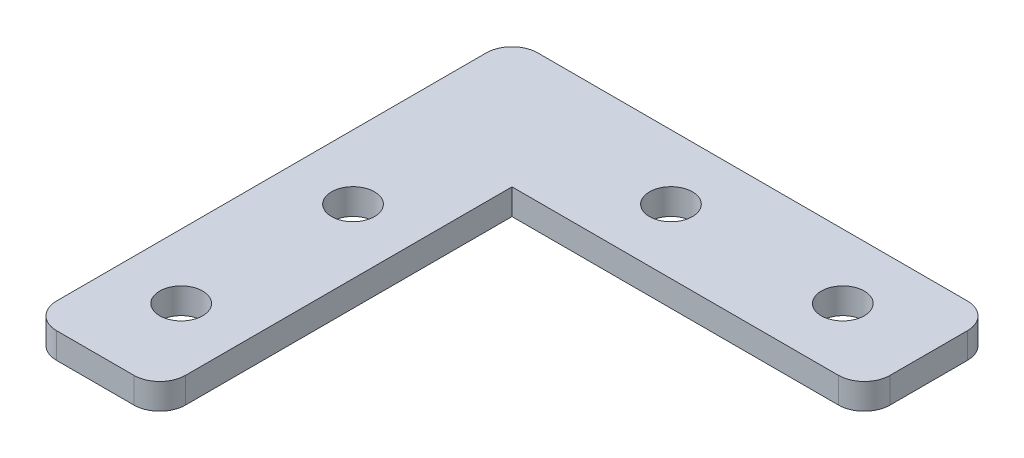
ISO-10303-21;
HEADER;
FILE_DESCRIPTION(('STEP AP214'),'2;1');
FILE_NAME('part.step','',(''),(''),'','','');
FILE_SCHEMA(('AUTOMOTIVE_DESIGN { 1 0 10303 214 1 1 1 1 }'));
ENDSEC;
DATA;
#1=APPLICATION_CONTEXT('core data for automotive mechanical design processes');
#2=APPLICATION_PROTOCOL_DEFINITION('international standard','automotive_design',2000,#1);
#3=PRODUCT_CONTEXT('',#1,'mechanical');
#4=PRODUCT('Part','Part','',(#3));
#5=PRODUCT_RELATED_PRODUCT_CATEGORY('part','',(#4));
#6=PRODUCT_DEFINITION_FORMATION('','',#4);
#7=PRODUCT_DEFINITION_CONTEXT('part definition',#1,'design');
#8=PRODUCT_DEFINITION('design','',#6,#7);
#9=PRODUCT_DEFINITION_SHAPE('','',#8);
#10=(LENGTH_UNIT() NAMED_UNIT(*) SI_UNIT(.MILLI.,.METRE.));
#11=(NAMED_UNIT(*) PLANE_ANGLE_UNIT() SI_UNIT($,.RADIAN.));
#12=(NAMED_UNIT(*) SI_UNIT($,.STERADIAN.) SOLID_ANGLE_UNIT());
#13=UNCERTAINTY_MEASURE_WITH_UNIT(LENGTH_MEASURE(1.E-05),#10,'distance_accuracy_value','');
#14=(GEOMETRIC_REPRESENTATION_CONTEXT(3) GLOBAL_UNCERTAINTY_ASSIGNED_CONTEXT((#13)) GLOBAL_UNIT_ASSIGNED_CONTEXT((#10,
#11,#12)) REPRESENTATION_CONTEXT('',''));
#15=CARTESIAN_POINT('',(0.,0.,0.));
#16=DIRECTION('',(0.,0.,1.));
#17=DIRECTION('',(1.,0.,0.));
#18=AXIS2_PLACEMENT_3D('',#15,#16,#17);
#19=CARTESIAN_POINT('',(0.,3.,0.));
#20=DIRECTION('',(0.,-1.,0.));
#21=DIRECTION('',(0.,0.,-1.));
#22=AXIS2_PLACEMENT_3D('',#19,#20,#21);
#23=PLANE('',#22);
#24=DIRECTION('',(-1.,0.,0.));
#25=VECTOR('',#24,1.);
#26=CARTESIAN_POINT('',(-28.,3.,-28.));
#27=LINE('',#26,#25);
#28=CARTESIAN_POINT('',(25.,3.,-28.));
#29=VERTEX_POINT('',#28);
#30=CARTESIAN_POINT('',(-25.,3.,-28.));
#31=VERTEX_POINT('',#30);
#32=EDGE_CURVE('E128',#29,#31,#27,.T.);
#33=ORIENTED_EDGE('',*,*,#32,.T.);
#34=CARTESIAN_POINT('',(-25.,3.,-25.));
#35=DIRECTION('',(0.,-1.,0.));
#36=DIRECTION('',(0.,0.,-1.));
#37=AXIS2_PLACEMENT_3D('',#34,#35,#36);
#38=CIRCLE('',#37,3.);
#39=CARTESIAN_POINT('',(-28.,3.,-25.));
#40=VERTEX_POINT('',#39);
#41=EDGE_CURVE('E175',#31,#40,#38,.F.);
#42=ORIENTED_EDGE('',*,*,#41,.T.);
#43=DIRECTION('',(0.,0.,1.));
#44=VECTOR('',#43,1.);
#45=CARTESIAN_POINT('',(-28.,3.,28.));
#46=LINE('',#45,#44);
#47=CARTESIAN_POINT('',(-28.,3.,25.));
#48=VERTEX_POINT('',#47);
#49=EDGE_CURVE('E121',#40,#48,#46,.T.);
#50=ORIENTED_EDGE('',*,*,#49,.T.);
#51=CARTESIAN_POINT('',(-25.,3.,25.));
#52=DIRECTION('',(0.,-1.,0.));
#53=DIRECTION('',(0.,0.,-1.));
#54=AXIS2_PLACEMENT_3D('',#51,#52,#53);
#55=CIRCLE('',#54,3.);
#56=CARTESIAN_POINT('',(-25.,3.,28.));
#57=VERTEX_POINT('',#56);
#58=EDGE_CURVE('E169',#48,#57,#55,.F.);
#59=ORIENTED_EDGE('',*,*,#58,.T.);
#60=DIRECTION('',(1.,0.,0.));
#61=VECTOR('',#60,1.);
#62=CARTESIAN_POINT('',(-13.,3.,28.));
#63=LINE('',#62,#61);
#64=CARTESIAN_POINT('',(-16.,3.,28.));
#65=VERTEX_POINT('',#64);
#66=EDGE_CURVE('E110',#57,#65,#63,.T.);
#67=ORIENTED_EDGE('',*,*,#66,.T.);
#68=CARTESIAN_POINT('',(-16.,3.,25.));
#69=DIRECTION('',(0.,-1.,0.));
#70=DIRECTION('',(0.,0.,-1.));
#71=AXIS2_PLACEMENT_3D('',#68,#69,#70);
#72=CIRCLE('',#71,3.);
#73=CARTESIAN_POINT('',(-13.,3.,25.));
#74=VERTEX_POINT('',#73);
#75=EDGE_CURVE('E106',#65,#74,#72,.F.);
#76=ORIENTED_EDGE('',*,*,#75,.T.);
#77=DIRECTION('',(0.,0.,-1.));
#78=VECTOR('',#77,1.);
#79=CARTESIAN_POINT('',(-13.,3.,-13.));
#80=LINE('',#79,#78);
#81=CARTESIAN_POINT('',(-13.,3.,-13.));
#82=VERTEX_POINT('',#81);
#83=EDGE_CURVE('E98',#74,#82,#80,.T.);
#84=ORIENTED_EDGE('',*,*,#83,.T.);
#85=DIRECTION('',(1.,0.,0.));
#86=VECTOR('',#85,1.);
#87=CARTESIAN_POINT('',(28.,3.,-13.));
#88=LINE('',#87,#86);
#89=CARTESIAN_POINT('',(25.,3.,-13.));
#90=VERTEX_POINT('',#89);
#91=EDGE_CURVE('E103',#82,#90,#88,.T.);
#92=ORIENTED_EDGE('',*,*,#91,.T.);
#93=CARTESIAN_POINT('',(25.,3.,-16.));
#94=DIRECTION('',(0.,-1.,0.));
#95=DIRECTION('',(0.,0.,-1.));
#96=AXIS2_PLACEMENT_3D('',#93,#94,#95);
#97=CIRCLE('',#96,3.);
#98=CARTESIAN_POINT('',(28.,3.,-16.));
#99=VERTEX_POINT('',#98);
#100=EDGE_CURVE('E38',#90,#99,#97,.F.);
#101=ORIENTED_EDGE('',*,*,#100,.T.);
#102=DIRECTION('',(0.,0.,-1.));
#103=VECTOR('',#102,1.);
#104=CARTESIAN_POINT('',(28.,3.,-28.));
#105=LINE('',#104,#103);
#106=CARTESIAN_POINT('',(28.,3.,-25.));
#107=VERTEX_POINT('',#106);
#108=EDGE_CURVE('E126',#99,#107,#105,.T.);
#109=ORIENTED_EDGE('',*,*,#108,.T.);
#110=CARTESIAN_POINT('',(25.,3.,-25.));
#111=DIRECTION('',(0.,-1.,0.));
#112=DIRECTION('',(0.,0.,-1.));
#113=AXIS2_PLACEMENT_3D('',#110,#111,#112);
#114=CIRCLE('',#113,3.);
#115=EDGE_CURVE('E173',#107,#29,#114,.F.);
#116=ORIENTED_EDGE('',*,*,#115,.T.);
#117=EDGE_LOOP('',(#33,#42,#50,#59,#67,#76,#84,#92,#101,#109,#116));
#118=FACE_BOUND('',#117,.T.);
#119=CARTESIAN_POINT('',(-20.5,3.,18.));
#120=DIRECTION('',(0.,1.,0.));
#121=DIRECTION('',(0.,0.,1.));
#122=AXIS2_PLACEMENT_3D('',#119,#120,#121);
#123=CIRCLE('',#122,2.5);
#124=CARTESIAN_POINT('',(-20.5,3.,20.5));
#125=VERTEX_POINT('',#124);
#126=EDGE_CURVE('E138',#125,#125,#123,.T.);
#127=ORIENTED_EDGE('',*,*,#126,.F.);
#128=EDGE_LOOP('',(#127));
#129=FACE_BOUND('',#128,.T.);
#130=CARTESIAN_POINT('',(-1.99999999999999,3.,-20.5));
#131=DIRECTION('',(0.,1.,0.));
#132=DIRECTION('',(0.,0.,1.));
#133=AXIS2_PLACEMENT_3D('',#130,#131,#132);
#134=CIRCLE('',#133,2.5);
#135=CARTESIAN_POINT('',(-1.99999999999999,3.,-18.));
#136=VERTEX_POINT('',#135);
#137=EDGE_CURVE('E202',#136,#136,#134,.T.);
#138=ORIENTED_EDGE('',*,*,#137,.F.);
#139=EDGE_LOOP('',(#138));
#140=FACE_BOUND('',#139,.T.);
#141=CARTESIAN_POINT('',(-20.5,3.,-2.));
#142=DIRECTION('',(0.,1.,0.));
#143=DIRECTION('',(0.,0.,1.));
#144=AXIS2_PLACEMENT_3D('',#141,#142,#143);
#145=CIRCLE('',#144,2.5);
#146=CARTESIAN_POINT('',(-20.5,3.,0.5));
#147=VERTEX_POINT('',#146);
#148=EDGE_CURVE('E208',#147,#147,#145,.T.);
#149=ORIENTED_EDGE('',*,*,#148,.F.);
#150=EDGE_LOOP('',(#149));
#151=FACE_BOUND('',#150,.T.);
#152=CARTESIAN_POINT('',(18.,3.,-20.5));
#153=DIRECTION('',(0.,1.,0.));
#154=DIRECTION('',(0.,0.,1.));
#155=AXIS2_PLACEMENT_3D('',#152,#153,#154);
#156=CIRCLE('',#155,2.5);
#157=CARTESIAN_POINT('',(18.,3.,-18.));
#158=VERTEX_POINT('',#157);
#159=EDGE_CURVE('E214',#158,#158,#156,.T.);
#160=ORIENTED_EDGE('',*,*,#159,.F.);
#161=EDGE_LOOP('',(#160));
#162=FACE_BOUND('',#161,.T.);
#163=ADVANCED_FACE('F16',(#118,#129,#140,#151,#162),#23,.F.);
#164=CARTESIAN_POINT('',(0.,0.,0.));
#165=DIRECTION('',(0.,-1.,0.));
#166=DIRECTION('',(0.,0.,-1.));
#167=AXIS2_PLACEMENT_3D('',#164,#165,#166);
#168=PLANE('',#167);
#169=CARTESIAN_POINT('',(-20.5,0.,-2.));
#170=DIRECTION('',(0.,1.,0.));
#171=DIRECTION('',(0.,0.,1.));
#172=AXIS2_PLACEMENT_3D('',#169,#170,#171);
#173=CIRCLE('',#172,2.5);
#174=CARTESIAN_POINT('',(-20.5,0.,0.5));
#175=VERTEX_POINT('',#174);
#176=EDGE_CURVE('E211',#175,#175,#173,.T.);
#177=ORIENTED_EDGE('',*,*,#176,.T.);
#178=EDGE_LOOP('',(#177));
#179=FACE_BOUND('',#178,.T.);
#180=CARTESIAN_POINT('',(-20.5,0.,18.));
#181=DIRECTION('',(0.,1.,0.));
#182=DIRECTION('',(0.,0.,1.));
#183=AXIS2_PLACEMENT_3D('',#180,#181,#182);
#184=CIRCLE('',#183,2.5);
#185=CARTESIAN_POINT('',(-20.5,0.,20.5));
#186=VERTEX_POINT('',#185);
#187=EDGE_CURVE('E199',#186,#186,#184,.T.);
#188=ORIENTED_EDGE('',*,*,#187,.T.);
#189=EDGE_LOOP('',(#188));
#190=FACE_BOUND('',#189,.T.);
#191=DIRECTION('',(0.,0.,1.));
#192=VECTOR('',#191,1.);
#193=CARTESIAN_POINT('',(-28.,0.,28.));
#194=LINE('',#193,#192);
#195=CARTESIAN_POINT('',(-28.,0.,-25.));
#196=VERTEX_POINT('',#195);
#197=CARTESIAN_POINT('',(-28.,0.,25.));
#198=VERTEX_POINT('',#197);
#199=EDGE_CURVE('E147',#196,#198,#194,.T.);
#200=ORIENTED_EDGE('',*,*,#199,.F.);
#201=CARTESIAN_POINT('',(-25.,0.,-25.));
#202=DIRECTION('',(0.,-1.,0.));
#203=DIRECTION('',(0.,0.,-1.));
#204=AXIS2_PLACEMENT_3D('',#201,#202,#203);
#205=CIRCLE('',#204,3.);
#206=CARTESIAN_POINT('',(-25.,0.,-28.));
#207=VERTEX_POINT('',#206);
#208=EDGE_CURVE('E162',#196,#207,#205,.T.);
#209=ORIENTED_EDGE('',*,*,#208,.T.);
#210=DIRECTION('',(-1.,0.,0.));
#211=VECTOR('',#210,1.);
#212=CARTESIAN_POINT('',(-28.,0.,-28.));
#213=LINE('',#212,#211);
#214=CARTESIAN_POINT('',(25.,0.,-28.));
#215=VERTEX_POINT('',#214);
#216=EDGE_CURVE('E144',#215,#207,#213,.T.);
#217=ORIENTED_EDGE('',*,*,#216,.F.);
#218=CARTESIAN_POINT('',(25.,0.,-25.));
#219=DIRECTION('',(0.,-1.,0.));
#220=DIRECTION('',(0.,0.,-1.));
#221=AXIS2_PLACEMENT_3D('',#218,#219,#220);
#222=CIRCLE('',#221,3.);
#223=CARTESIAN_POINT('',(28.,0.,-25.));
#224=VERTEX_POINT('',#223);
#225=EDGE_CURVE('E160',#215,#224,#222,.T.);
#226=ORIENTED_EDGE('',*,*,#225,.T.);
#227=DIRECTION('',(0.,0.,-1.));
#228=VECTOR('',#227,1.);
#229=CARTESIAN_POINT('',(28.,0.,-28.));
#230=LINE('',#229,#228);
#231=CARTESIAN_POINT('',(28.,0.,-16.));
#232=VERTEX_POINT('',#231);
#233=EDGE_CURVE('E142',#232,#224,#230,.T.);
#234=ORIENTED_EDGE('',*,*,#233,.F.);
#235=CARTESIAN_POINT('',(25.,0.,-16.));
#236=DIRECTION('',(0.,-1.,0.));
#237=DIRECTION('',(0.,0.,-1.));
#238=AXIS2_PLACEMENT_3D('',#235,#236,#237);
#239=CIRCLE('',#238,3.);
#240=CARTESIAN_POINT('',(25.,0.,-13.));
#241=VERTEX_POINT('',#240);
#242=EDGE_CURVE('E158',#232,#241,#239,.T.);
#243=ORIENTED_EDGE('',*,*,#242,.T.);
#244=DIRECTION('',(1.,0.,0.));
#245=VECTOR('',#244,1.);
#246=CARTESIAN_POINT('',(28.,0.,-13.));
#247=LINE('',#246,#245);
#248=CARTESIAN_POINT('',(-13.,0.,-13.));
#249=VERTEX_POINT('',#248);
#250=EDGE_CURVE('E140',#249,#241,#247,.T.);
#251=ORIENTED_EDGE('',*,*,#250,.F.);
#252=DIRECTION('',(0.,0.,-1.));
#253=VECTOR('',#252,1.);
#254=CARTESIAN_POINT('',(-13.,0.,-13.));
#255=LINE('',#254,#253);
#256=CARTESIAN_POINT('',(-13.,0.,25.));
#257=VERTEX_POINT('',#256);
#258=EDGE_CURVE('E116',#257,#249,#255,.T.);
#259=ORIENTED_EDGE('',*,*,#258,.F.);
#260=CARTESIAN_POINT('',(-16.,0.,25.));
#261=DIRECTION('',(0.,-1.,0.));
#262=DIRECTION('',(0.,0.,-1.));
#263=AXIS2_PLACEMENT_3D('',#260,#261,#262);
#264=CIRCLE('',#263,3.);
#265=CARTESIAN_POINT('',(-16.,0.,28.));
#266=VERTEX_POINT('',#265);
#267=EDGE_CURVE('E156',#257,#266,#264,.T.);
#268=ORIENTED_EDGE('',*,*,#267,.T.);
#269=DIRECTION('',(1.,0.,0.));
#270=VECTOR('',#269,1.);
#271=CARTESIAN_POINT('',(-13.,0.,28.));
#272=LINE('',#271,#270);
#273=CARTESIAN_POINT('',(-25.,0.,28.));
#274=VERTEX_POINT('',#273);
#275=EDGE_CURVE('E135',#274,#266,#272,.T.);
#276=ORIENTED_EDGE('',*,*,#275,.F.);
#277=CARTESIAN_POINT('',(-25.,0.,25.));
#278=DIRECTION('',(0.,-1.,0.));
#279=DIRECTION('',(0.,0.,-1.));
#280=AXIS2_PLACEMENT_3D('',#277,#278,#279);
#281=CIRCLE('',#280,3.);
#282=EDGE_CURVE('E154',#274,#198,#281,.T.);
#283=ORIENTED_EDGE('',*,*,#282,.T.);
#284=EDGE_LOOP('',(#200,#209,#217,#226,#234,#243,#251,#259,#268,#276,#283));
#285=FACE_BOUND('',#284,.T.);
#286=CARTESIAN_POINT('',(-1.99999999999999,0.,-20.5));
#287=DIRECTION('',(0.,1.,0.));
#288=DIRECTION('',(0.,0.,1.));
#289=AXIS2_PLACEMENT_3D('',#286,#287,#288);
#290=CIRCLE('',#289,2.5);
#291=CARTESIAN_POINT('',(-1.99999999999999,0.,-18.));
#292=VERTEX_POINT('',#291);
#293=EDGE_CURVE('E205',#292,#292,#290,.T.);
#294=ORIENTED_EDGE('',*,*,#293,.T.);
#295=EDGE_LOOP('',(#294));
#296=FACE_BOUND('',#295,.T.);
#297=CARTESIAN_POINT('',(18.,0.,-20.5));
#298=DIRECTION('',(0.,1.,0.));
#299=DIRECTION('',(0.,0.,1.));
#300=AXIS2_PLACEMENT_3D('',#297,#298,#299);
#301=CIRCLE('',#300,2.5);
#302=CARTESIAN_POINT('',(18.,0.,-18.));
#303=VERTEX_POINT('',#302);
#304=EDGE_CURVE('E217',#303,#303,#301,.T.);
#305=ORIENTED_EDGE('',*,*,#304,.T.);
#306=EDGE_LOOP('',(#305));
#307=FACE_BOUND('',#306,.T.);
#308=ADVANCED_FACE('F194',(#179,#190,#285,#296,#307),#168,.T.);
#309=CARTESIAN_POINT('',(-13.,3.,28.));
#310=DIRECTION('',(0.,0.,-1.));
#311=DIRECTION('',(-1.,0.,0.));
#312=AXIS2_PLACEMENT_3D('',#309,#310,#311);
#313=PLANE('',#312);
#314=ORIENTED_EDGE('',*,*,#275,.T.);
#315=DIRECTION('',(0.,-1.,0.));
#316=VECTOR('',#315,1.);
#317=CARTESIAN_POINT('',(-16.,3.,28.));
#318=LINE('',#317,#316);
#319=EDGE_CURVE('E10',#266,#65,#318,.F.);
#320=ORIENTED_EDGE('',*,*,#319,.T.);
#321=ORIENTED_EDGE('',*,*,#66,.F.);
#322=DIRECTION('',(0.,-1.,0.));
#323=VECTOR('',#322,1.);
#324=CARTESIAN_POINT('',(-25.,3.,28.));
#325=LINE('',#324,#323);
#326=EDGE_CURVE('E24',#57,#274,#325,.T.);
#327=ORIENTED_EDGE('',*,*,#326,.T.);
#328=EDGE_LOOP('',(#314,#320,#321,#327));
#329=FACE_BOUND('',#328,.T.);
#330=ADVANCED_FACE('F188',(#329),#313,.F.);
#331=CARTESIAN_POINT('',(-13.,3.,-13.));
#332=DIRECTION('',(-1.,0.,0.));
#333=DIRECTION('',(0.,0.,1.));
#334=AXIS2_PLACEMENT_3D('',#331,#332,#333);
#335=PLANE('',#334);
#336=ORIENTED_EDGE('',*,*,#83,.F.);
#337=DIRECTION('',(0.,-1.,0.));
#338=VECTOR('',#337,1.);
#339=CARTESIAN_POINT('',(-13.,3.,25.));
#340=LINE('',#339,#338);
#341=EDGE_CURVE('E182',#74,#257,#340,.T.);
#342=ORIENTED_EDGE('',*,*,#341,.T.);
#343=ORIENTED_EDGE('',*,*,#258,.T.);
#344=DIRECTION('',(0.,-1.,0.));
#345=VECTOR('',#344,1.);
#346=CARTESIAN_POINT('',(-13.,3.,-13.));
#347=LINE('',#346,#345);
#348=EDGE_CURVE('E113',#82,#249,#347,.T.);
#349=ORIENTED_EDGE('',*,*,#348,.F.);
#350=EDGE_LOOP('',(#336,#342,#343,#349));
#351=FACE_BOUND('',#350,.T.);
#352=ADVANCED_FACE('F114',(#351),#335,.F.);
#353=CARTESIAN_POINT('',(28.,3.,-13.));
#354=DIRECTION('',(0.,0.,-1.));
#355=DIRECTION('',(-1.,0.,0.));
#356=AXIS2_PLACEMENT_3D('',#353,#354,#355);
#357=PLANE('',#356);
#358=ORIENTED_EDGE('',*,*,#250,.T.);
#359=DIRECTION('',(0.,-1.,0.));
#360=VECTOR('',#359,1.);
#361=CARTESIAN_POINT('',(25.,3.,-13.));
#362=LINE('',#361,#360);
#363=EDGE_CURVE('E125',#241,#90,#362,.F.);
#364=ORIENTED_EDGE('',*,*,#363,.T.);
#365=ORIENTED_EDGE('',*,*,#91,.F.);
#366=ORIENTED_EDGE('',*,*,#348,.T.);
#367=EDGE_LOOP('',(#358,#364,#365,#366));
#368=FACE_BOUND('',#367,.T.);
#369=ADVANCED_FACE('F123',(#368),#357,.F.);
#370=CARTESIAN_POINT('',(28.,3.,-28.));
#371=DIRECTION('',(-1.,0.,0.));
#372=DIRECTION('',(0.,0.,1.));
#373=AXIS2_PLACEMENT_3D('',#370,#371,#372);
#374=PLANE('',#373);
#375=ORIENTED_EDGE('',*,*,#233,.T.);
#376=DIRECTION('',(0.,-1.,0.));
#377=VECTOR('',#376,1.);
#378=CARTESIAN_POINT('',(28.,3.,-25.));
#379=LINE('',#378,#377);
#380=EDGE_CURVE('E31',#224,#107,#379,.F.);
#381=ORIENTED_EDGE('',*,*,#380,.T.);
#382=ORIENTED_EDGE('',*,*,#108,.F.);
#383=DIRECTION('',(0.,-1.,0.));
#384=VECTOR('',#383,1.);
#385=CARTESIAN_POINT('',(28.,3.,-16.));
#386=LINE('',#385,#384);
#387=EDGE_CURVE('E177',#99,#232,#386,.T.);
#388=ORIENTED_EDGE('',*,*,#387,.T.);
#389=EDGE_LOOP('',(#375,#381,#382,#388));
#390=FACE_BOUND('',#389,.T.);
#391=ADVANCED_FACE('F245',(#390),#374,.F.);
#392=CARTESIAN_POINT('',(-28.,3.,-28.));
#393=DIRECTION('',(0.,0.,1.));
#394=DIRECTION('',(1.,0.,0.));
#395=AXIS2_PLACEMENT_3D('',#392,#393,#394);
#396=PLANE('',#395);
#397=ORIENTED_EDGE('',*,*,#216,.T.);
#398=DIRECTION('',(0.,-1.,0.));
#399=VECTOR('',#398,1.);
#400=CARTESIAN_POINT('',(-25.,3.,-28.));
#401=LINE('',#400,#399);
#402=EDGE_CURVE('E167',#207,#31,#401,.F.);
#403=ORIENTED_EDGE('',*,*,#402,.T.);
#404=ORIENTED_EDGE('',*,*,#32,.F.);
#405=DIRECTION('',(0.,-1.,0.));
#406=VECTOR('',#405,1.);
#407=CARTESIAN_POINT('',(25.,3.,-28.));
#408=LINE('',#407,#406);
#409=EDGE_CURVE('E164',#29,#215,#408,.T.);
#410=ORIENTED_EDGE('',*,*,#409,.T.);
#411=EDGE_LOOP('',(#397,#403,#404,#410));
#412=FACE_BOUND('',#411,.T.);
#413=ADVANCED_FACE('F241',(#412),#396,.F.);
#414=CARTESIAN_POINT('',(-28.,3.,28.));
#415=DIRECTION('',(1.,0.,0.));
#416=DIRECTION('',(0.,0.,-1.));
#417=AXIS2_PLACEMENT_3D('',#414,#415,#416);
#418=PLANE('',#417);
#419=ORIENTED_EDGE('',*,*,#49,.F.);
#420=DIRECTION('',(0.,-1.,0.));
#421=VECTOR('',#420,1.);
#422=CARTESIAN_POINT('',(-28.,3.,-25.));
#423=LINE('',#422,#421);
#424=EDGE_CURVE('E151',#40,#196,#423,.T.);
#425=ORIENTED_EDGE('',*,*,#424,.T.);
#426=ORIENTED_EDGE('',*,*,#199,.T.);
#427=DIRECTION('',(0.,-1.,0.));
#428=VECTOR('',#427,1.);
#429=CARTESIAN_POINT('',(-28.,3.,25.));
#430=LINE('',#429,#428);
#431=EDGE_CURVE('E120',#198,#48,#430,.F.);
#432=ORIENTED_EDGE('',*,*,#431,.T.);
#433=EDGE_LOOP('',(#419,#425,#426,#432));
#434=FACE_BOUND('',#433,.T.);
#435=ADVANCED_FACE('F238',(#434),#418,.F.);
#436=CARTESIAN_POINT('',(-20.5,3.,18.));
#437=DIRECTION('',(0.,-1.,0.));
#438=DIRECTION('',(0.,0.,-1.));
#439=AXIS2_PLACEMENT_3D('',#436,#437,#438);
#440=CYLINDRICAL_SURFACE('',#439,2.5);
#441=ORIENTED_EDGE('',*,*,#126,.T.);
#442=EDGE_LOOP('',(#441));
#443=FACE_BOUND('',#442,.T.);
#444=ORIENTED_EDGE('',*,*,#187,.F.);
#445=EDGE_LOOP('',(#444));
#446=FACE_BOUND('',#445,.T.);
#447=ADVANCED_FACE('F235',(#443,#446),#440,.F.);
#448=CARTESIAN_POINT('',(-1.99999999999999,3.,-20.5));
#449=DIRECTION('',(0.,-1.,0.));
#450=DIRECTION('',(0.,0.,-1.));
#451=AXIS2_PLACEMENT_3D('',#448,#449,#450);
#452=CYLINDRICAL_SURFACE('',#451,2.5);
#453=ORIENTED_EDGE('',*,*,#137,.T.);
#454=EDGE_LOOP('',(#453));
#455=FACE_BOUND('',#454,.T.);
#456=ORIENTED_EDGE('',*,*,#293,.F.);
#457=EDGE_LOOP('',(#456));
#458=FACE_BOUND('',#457,.T.);
#459=ADVANCED_FACE('F333',(#455,#458),#452,.F.);
#460=CARTESIAN_POINT('',(-20.5,3.,-2.));
#461=DIRECTION('',(0.,-1.,0.));
#462=DIRECTION('',(0.,0.,-1.));
#463=AXIS2_PLACEMENT_3D('',#460,#461,#462);
#464=CYLINDRICAL_SURFACE('',#463,2.5);
#465=ORIENTED_EDGE('',*,*,#148,.T.);
#466=EDGE_LOOP('',(#465));
#467=FACE_BOUND('',#466,.T.);
#468=ORIENTED_EDGE('',*,*,#176,.F.);
#469=EDGE_LOOP('',(#468));
#470=FACE_BOUND('',#469,.T.);
#471=ADVANCED_FACE('F322',(#467,#470),#464,.F.);
#472=CARTESIAN_POINT('',(18.,3.,-20.5));
#473=DIRECTION('',(0.,-1.,0.));
#474=DIRECTION('',(0.,0.,-1.));
#475=AXIS2_PLACEMENT_3D('',#472,#473,#474);
#476=CYLINDRICAL_SURFACE('',#475,2.5);
#477=ORIENTED_EDGE('',*,*,#159,.T.);
#478=EDGE_LOOP('',(#477));
#479=FACE_BOUND('',#478,.T.);
#480=ORIENTED_EDGE('',*,*,#304,.F.);
#481=EDGE_LOOP('',(#480));
#482=FACE_BOUND('',#481,.T.);
#483=ADVANCED_FACE('F223',(#479,#482),#476,.F.);
#484=CARTESIAN_POINT('',(-25.,3.,-25.));
#485=DIRECTION('',(0.,-1.,0.));
#486=DIRECTION('',(0.,0.,-1.));
#487=AXIS2_PLACEMENT_3D('',#484,#485,#486);
#488=CYLINDRICAL_SURFACE('',#487,3.);
#489=ORIENTED_EDGE('',*,*,#41,.F.);
#490=ORIENTED_EDGE('',*,*,#402,.F.);
#491=ORIENTED_EDGE('',*,*,#208,.F.);
#492=ORIENTED_EDGE('',*,*,#424,.F.);
#493=EDGE_LOOP('',(#489,#490,#491,#492));
#494=FACE_BOUND('',#493,.T.);
#495=ADVANCED_FACE('F255',(#494),#488,.T.);
#496=CARTESIAN_POINT('',(25.,3.,-25.));
#497=DIRECTION('',(0.,-1.,0.));
#498=DIRECTION('',(0.,0.,-1.));
#499=AXIS2_PLACEMENT_3D('',#496,#497,#498);
#500=CYLINDRICAL_SURFACE('',#499,3.);
#501=ORIENTED_EDGE('',*,*,#115,.F.);
#502=ORIENTED_EDGE('',*,*,#380,.F.);
#503=ORIENTED_EDGE('',*,*,#225,.F.);
#504=ORIENTED_EDGE('',*,*,#409,.F.);
#505=EDGE_LOOP('',(#501,#502,#503,#504));
#506=FACE_BOUND('',#505,.T.);
#507=ADVANCED_FACE('F258',(#506),#500,.T.);
#508=CARTESIAN_POINT('',(25.,3.,-16.));
#509=DIRECTION('',(0.,-1.,0.));
#510=DIRECTION('',(0.,0.,-1.));
#511=AXIS2_PLACEMENT_3D('',#508,#509,#510);
#512=CYLINDRICAL_SURFACE('',#511,3.);
#513=ORIENTED_EDGE('',*,*,#100,.F.);
#514=ORIENTED_EDGE('',*,*,#363,.F.);
#515=ORIENTED_EDGE('',*,*,#242,.F.);
#516=ORIENTED_EDGE('',*,*,#387,.F.);
#517=EDGE_LOOP('',(#513,#514,#515,#516));
#518=FACE_BOUND('',#517,.T.);
#519=ADVANCED_FACE('F262',(#518),#512,.T.);
#520=CARTESIAN_POINT('',(-16.,3.,25.));
#521=DIRECTION('',(0.,-1.,0.));
#522=DIRECTION('',(0.,0.,-1.));
#523=AXIS2_PLACEMENT_3D('',#520,#521,#522);
#524=CYLINDRICAL_SURFACE('',#523,3.);
#525=ORIENTED_EDGE('',*,*,#75,.F.);
#526=ORIENTED_EDGE('',*,*,#319,.F.);
#527=ORIENTED_EDGE('',*,*,#267,.F.);
#528=ORIENTED_EDGE('',*,*,#341,.F.);
#529=EDGE_LOOP('',(#525,#526,#527,#528));
#530=FACE_BOUND('',#529,.T.);
#531=ADVANCED_FACE('F197',(#530),#524,.T.);
#532=CARTESIAN_POINT('',(-25.,3.,25.));
#533=DIRECTION('',(0.,-1.,0.));
#534=DIRECTION('',(0.,0.,-1.));
#535=AXIS2_PLACEMENT_3D('',#532,#533,#534);
#536=CYLINDRICAL_SURFACE('',#535,3.);
#537=ORIENTED_EDGE('',*,*,#58,.F.);
#538=ORIENTED_EDGE('',*,*,#431,.F.);
#539=ORIENTED_EDGE('',*,*,#282,.F.);
#540=ORIENTED_EDGE('',*,*,#326,.F.);
#541=EDGE_LOOP('',(#537,#538,#539,#540));
#542=FACE_BOUND('',#541,.T.);
#543=ADVANCED_FACE('F18',(#542),#536,.T.);
#544=CLOSED_SHELL('',(#163,#308,#330,#352,#369,#391,#413,#435,#447,#459,#471,#483,#495,#507,
#519,#531,#543));
#545=MANIFOLD_SOLID_BREP('B1',#544);
#546=ADVANCED_BREP_SHAPE_REPRESENTATION('',(#18,#545),#14);
#547=SHAPE_DEFINITION_REPRESENTATION(#9,#546);
ENDSEC;
END-ISO-10303-21;
